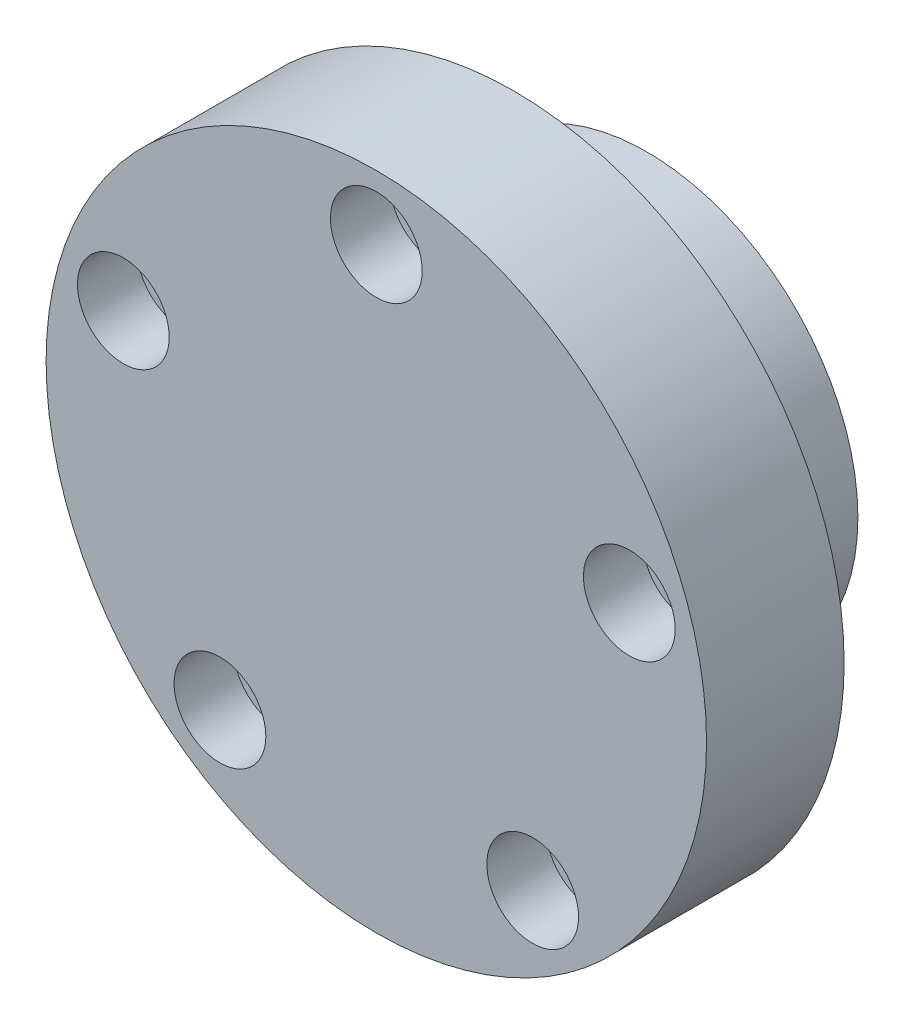
ISO-10303-21;
HEADER;
FILE_DESCRIPTION(('STEP AP214'),'2;1');
FILE_NAME('part.step','',(''),(''),'','','');
FILE_SCHEMA(('AUTOMOTIVE_DESIGN { 1 0 10303 214 1 1 1 1 }'));
ENDSEC;
DATA;
#1=APPLICATION_CONTEXT('core data for automotive mechanical design processes');
#2=APPLICATION_PROTOCOL_DEFINITION('international standard','automotive_design',2000,#1);
#3=PRODUCT_CONTEXT('',#1,'mechanical');
#4=PRODUCT('Part','Part','',(#3));
#5=PRODUCT_RELATED_PRODUCT_CATEGORY('part','',(#4));
#6=PRODUCT_DEFINITION_FORMATION('','',#4);
#7=PRODUCT_DEFINITION_CONTEXT('part definition',#1,'design');
#8=PRODUCT_DEFINITION('design','',#6,#7);
#9=PRODUCT_DEFINITION_SHAPE('','',#8);
#10=(LENGTH_UNIT() NAMED_UNIT(*) SI_UNIT(.MILLI.,.METRE.));
#11=(NAMED_UNIT(*) PLANE_ANGLE_UNIT() SI_UNIT($,.RADIAN.));
#12=(NAMED_UNIT(*) SI_UNIT($,.STERADIAN.) SOLID_ANGLE_UNIT());
#13=UNCERTAINTY_MEASURE_WITH_UNIT(LENGTH_MEASURE(1.E-05),#10,'distance_accuracy_value','');
#14=(GEOMETRIC_REPRESENTATION_CONTEXT(3) GLOBAL_UNCERTAINTY_ASSIGNED_CONTEXT((#13)) GLOBAL_UNIT_ASSIGNED_CONTEXT((#10,
#11,#12)) REPRESENTATION_CONTEXT('',''));
#15=CARTESIAN_POINT('',(0.,0.,0.));
#16=DIRECTION('',(0.,0.,1.));
#17=DIRECTION('',(1.,0.,0.));
#18=AXIS2_PLACEMENT_3D('',#15,#16,#17);
#19=CARTESIAN_POINT('',(-13.7903194862798,4.48074641843648,-9.25));
#20=DIRECTION('',(0.,0.,1.));
#21=DIRECTION('',(1.,0.,0.));
#22=AXIS2_PLACEMENT_3D('',#19,#20,#21);
#23=CYLINDRICAL_SURFACE('',#22,1.524);
#24=CARTESIAN_POINT('',(-13.7903194862798,4.48074641843648,0.));
#25=DIRECTION('',(0.,0.,1.));
#26=DIRECTION('',(1.,0.,0.));
#27=AXIS2_PLACEMENT_3D('',#24,#25,#26);
#28=CIRCLE('',#27,1.524);
#29=CARTESIAN_POINT('',(-12.2663194862798,4.48074641843648,0.));
#30=VERTEX_POINT('',#29);
#31=EDGE_CURVE('E55',#30,#30,#28,.T.);
#32=ORIENTED_EDGE('',*,*,#31,.F.);
#33=EDGE_LOOP('',(#32));
#34=FACE_BOUND('',#33,.T.);
#35=CARTESIAN_POINT('',(-13.7903194862798,4.48074641843648,4.25));
#36=DIRECTION('',(0.,0.,1.));
#37=DIRECTION('',(1.,0.,0.));
#38=AXIS2_PLACEMENT_3D('',#35,#36,#37);
#39=CIRCLE('',#38,1.524);
#40=CARTESIAN_POINT('',(-12.2663194862798,4.48074641843648,4.25));
#41=VERTEX_POINT('',#40);
#42=EDGE_CURVE('E37',#41,#41,#39,.F.);
#43=ORIENTED_EDGE('',*,*,#42,.F.);
#44=EDGE_LOOP('',(#43));
#45=FACE_BOUND('',#44,.T.);
#46=ADVANCED_FACE('F33',(#34,#45),#23,.F.);
#47=CARTESIAN_POINT('',(-8.5228861582407,-11.7307464184369,-9.25));
#48=DIRECTION('',(0.,0.,1.));
#49=DIRECTION('',(1.,0.,0.));
#50=AXIS2_PLACEMENT_3D('',#47,#48,#49);
#51=CYLINDRICAL_SURFACE('',#50,1.524);
#52=CARTESIAN_POINT('',(-8.5228861582407,-11.7307464184369,0.));
#53=DIRECTION('',(0.,0.,1.));
#54=DIRECTION('',(1.,0.,0.));
#55=AXIS2_PLACEMENT_3D('',#52,#53,#54);
#56=CIRCLE('',#55,1.524);
#57=CARTESIAN_POINT('',(-6.9988861582407,-11.7307464184369,0.));
#58=VERTEX_POINT('',#57);
#59=EDGE_CURVE('E58',#58,#58,#56,.T.);
#60=ORIENTED_EDGE('',*,*,#59,.F.);
#61=EDGE_LOOP('',(#60));
#62=FACE_BOUND('',#61,.T.);
#63=CARTESIAN_POINT('',(-8.5228861582407,-11.7307464184369,4.25));
#64=DIRECTION('',(0.,0.,1.));
#65=DIRECTION('',(1.,0.,0.));
#66=AXIS2_PLACEMENT_3D('',#63,#64,#65);
#67=CIRCLE('',#66,1.524);
#68=CARTESIAN_POINT('',(-6.9988861582407,-11.7307464184369,4.25));
#69=VERTEX_POINT('',#68);
#70=EDGE_CURVE('E76',#69,#69,#67,.F.);
#71=ORIENTED_EDGE('',*,*,#70,.F.);
#72=EDGE_LOOP('',(#71));
#73=FACE_BOUND('',#72,.T.);
#74=ADVANCED_FACE('F125',(#62,#73),#51,.F.);
#75=CARTESIAN_POINT('',(8.52288615824097,-11.7307464184367,-9.25));
#76=DIRECTION('',(0.,0.,1.));
#77=DIRECTION('',(1.,0.,0.));
#78=AXIS2_PLACEMENT_3D('',#75,#76,#77);
#79=CYLINDRICAL_SURFACE('',#78,1.524);
#80=CARTESIAN_POINT('',(8.52288615824097,-11.7307464184367,0.));
#81=DIRECTION('',(0.,0.,1.));
#82=DIRECTION('',(1.,0.,0.));
#83=AXIS2_PLACEMENT_3D('',#80,#81,#82);
#84=CIRCLE('',#83,1.524);
#85=CARTESIAN_POINT('',(10.046886158241,-11.7307464184367,0.));
#86=VERTEX_POINT('',#85);
#87=EDGE_CURVE('E62',#86,#86,#84,.T.);
#88=ORIENTED_EDGE('',*,*,#87,.F.);
#89=EDGE_LOOP('',(#88));
#90=FACE_BOUND('',#89,.T.);
#91=CARTESIAN_POINT('',(8.52288615824097,-11.7307464184367,4.25));
#92=DIRECTION('',(0.,0.,1.));
#93=DIRECTION('',(1.,0.,0.));
#94=AXIS2_PLACEMENT_3D('',#91,#92,#93);
#95=CIRCLE('',#94,1.524);
#96=CARTESIAN_POINT('',(10.046886158241,-11.7307464184367,4.25));
#97=VERTEX_POINT('',#96);
#98=EDGE_CURVE('E73',#97,#97,#95,.F.);
#99=ORIENTED_EDGE('',*,*,#98,.F.);
#100=EDGE_LOOP('',(#99));
#101=FACE_BOUND('',#100,.T.);
#102=ADVANCED_FACE('F131',(#90,#101),#79,.F.);
#103=CARTESIAN_POINT('',(13.7903194862797,4.4807464184368,-9.25));
#104=DIRECTION('',(0.,0.,1.));
#105=DIRECTION('',(1.,0.,0.));
#106=AXIS2_PLACEMENT_3D('',#103,#104,#105);
#107=CYLINDRICAL_SURFACE('',#106,1.524);
#108=CARTESIAN_POINT('',(13.7903194862797,4.4807464184368,0.));
#109=DIRECTION('',(0.,0.,1.));
#110=DIRECTION('',(1.,0.,0.));
#111=AXIS2_PLACEMENT_3D('',#108,#109,#110);
#112=CIRCLE('',#111,1.524);
#113=CARTESIAN_POINT('',(15.3143194862797,4.4807464184368,0.));
#114=VERTEX_POINT('',#113);
#115=EDGE_CURVE('E54',#114,#114,#112,.T.);
#116=ORIENTED_EDGE('',*,*,#115,.F.);
#117=EDGE_LOOP('',(#116));
#118=FACE_BOUND('',#117,.T.);
#119=CARTESIAN_POINT('',(13.7903194862797,4.4807464184368,4.25));
#120=DIRECTION('',(0.,0.,1.));
#121=DIRECTION('',(1.,0.,0.));
#122=AXIS2_PLACEMENT_3D('',#119,#120,#121);
#123=CIRCLE('',#122,1.524);
#124=CARTESIAN_POINT('',(15.3143194862797,4.4807464184368,4.25));
#125=VERTEX_POINT('',#124);
#126=EDGE_CURVE('E70',#125,#125,#123,.F.);
#127=ORIENTED_EDGE('',*,*,#126,.F.);
#128=EDGE_LOOP('',(#127));
#129=FACE_BOUND('',#128,.T.);
#130=ADVANCED_FACE('F141',(#118,#129),#107,.F.);
#131=CARTESIAN_POINT('',(0.,14.5,-9.25));
#132=DIRECTION('',(0.,0.,1.));
#133=DIRECTION('',(1.,0.,0.));
#134=AXIS2_PLACEMENT_3D('',#131,#132,#133);
#135=CYLINDRICAL_SURFACE('',#134,1.524);
#136=CARTESIAN_POINT('',(0.,14.5,0.));
#137=DIRECTION('',(0.,0.,1.));
#138=DIRECTION('',(1.,0.,0.));
#139=AXIS2_PLACEMENT_3D('',#136,#137,#138);
#140=CIRCLE('',#139,1.524);
#141=CARTESIAN_POINT('',(1.524,14.5,0.));
#142=VERTEX_POINT('',#141);
#143=EDGE_CURVE('E50',#142,#142,#140,.T.);
#144=ORIENTED_EDGE('',*,*,#143,.F.);
#145=EDGE_LOOP('',(#144));
#146=FACE_BOUND('',#145,.T.);
#147=CARTESIAN_POINT('',(0.,14.5,4.25));
#148=DIRECTION('',(0.,0.,1.));
#149=DIRECTION('',(1.,0.,0.));
#150=AXIS2_PLACEMENT_3D('',#147,#148,#149);
#151=CIRCLE('',#150,1.524);
#152=CARTESIAN_POINT('',(1.524,14.5,4.25));
#153=VERTEX_POINT('',#152);
#154=EDGE_CURVE('E59',#153,#153,#151,.F.);
#155=ORIENTED_EDGE('',*,*,#154,.F.);
#156=EDGE_LOOP('',(#155));
#157=FACE_BOUND('',#156,.T.);
#158=ADVANCED_FACE('F138',(#146,#157),#135,.F.);
#159=CARTESIAN_POINT('',(0.,0.,7.5));
#160=DIRECTION('',(0.,0.,-1.));
#161=DIRECTION('',(-1.,0.,0.));
#162=AXIS2_PLACEMENT_3D('',#159,#160,#161);
#163=CYLINDRICAL_SURFACE('',#162,18.);
#164=CARTESIAN_POINT('',(0.,0.,7.5));
#165=DIRECTION('',(0.,0.,1.));
#166=DIRECTION('',(1.,0.,0.));
#167=AXIS2_PLACEMENT_3D('',#164,#165,#166);
#168=CIRCLE('',#167,18.);
#169=CARTESIAN_POINT('',(18.,0.,7.5));
#170=VERTEX_POINT('',#169);
#171=EDGE_CURVE('E41',#170,#170,#168,.T.);
#172=ORIENTED_EDGE('',*,*,#171,.F.);
#173=EDGE_LOOP('',(#172));
#174=FACE_BOUND('',#173,.T.);
#175=CARTESIAN_POINT('',(0.,0.,0.));
#176=DIRECTION('',(0.,0.,1.));
#177=DIRECTION('',(1.,0.,0.));
#178=AXIS2_PLACEMENT_3D('',#175,#176,#177);
#179=CIRCLE('',#178,18.);
#180=CARTESIAN_POINT('',(18.,0.,0.));
#181=VERTEX_POINT('',#180);
#182=EDGE_CURVE('E46',#181,#181,#179,.T.);
#183=ORIENTED_EDGE('',*,*,#182,.T.);
#184=EDGE_LOOP('',(#183));
#185=FACE_BOUND('',#184,.T.);
#186=ADVANCED_FACE('F35',(#174,#185),#163,.T.);
#187=CARTESIAN_POINT('',(0.,0.,7.5));
#188=DIRECTION('',(0.,0.,1.));
#189=DIRECTION('',(1.,0.,0.));
#190=AXIS2_PLACEMENT_3D('',#187,#188,#189);
#191=PLANE('',#190);
#192=CARTESIAN_POINT('',(13.7903194862797,4.4807464184368,7.5));
#193=DIRECTION('',(0.,0.,1.));
#194=DIRECTION('',(1.,0.,0.));
#195=AXIS2_PLACEMENT_3D('',#192,#193,#194);
#196=CIRCLE('',#195,2.5);
#197=CARTESIAN_POINT('',(16.2903194862797,4.4807464184368,7.5));
#198=VERTEX_POINT('',#197);
#199=EDGE_CURVE('E364',#198,#198,#196,.T.);
#200=ORIENTED_EDGE('',*,*,#199,.F.);
#201=EDGE_LOOP('',(#200));
#202=FACE_BOUND('',#201,.T.);
#203=CARTESIAN_POINT('',(8.52288615824097,-11.7307464184367,7.5));
#204=DIRECTION('',(0.,0.,1.));
#205=DIRECTION('',(1.,0.,0.));
#206=AXIS2_PLACEMENT_3D('',#203,#204,#205);
#207=CIRCLE('',#206,2.5);
#208=CARTESIAN_POINT('',(11.022886158241,-11.7307464184367,7.5));
#209=VERTEX_POINT('',#208);
#210=EDGE_CURVE('E358',#209,#209,#207,.T.);
#211=ORIENTED_EDGE('',*,*,#210,.F.);
#212=EDGE_LOOP('',(#211));
#213=FACE_BOUND('',#212,.T.);
#214=CARTESIAN_POINT('',(-8.5228861582407,-11.7307464184369,7.5));
#215=DIRECTION('',(0.,0.,1.));
#216=DIRECTION('',(1.,0.,0.));
#217=AXIS2_PLACEMENT_3D('',#214,#215,#216);
#218=CIRCLE('',#217,2.5);
#219=CARTESIAN_POINT('',(-6.0228861582407,-11.7307464184369,7.5));
#220=VERTEX_POINT('',#219);
#221=EDGE_CURVE('E350',#220,#220,#218,.T.);
#222=ORIENTED_EDGE('',*,*,#221,.F.);
#223=EDGE_LOOP('',(#222));
#224=FACE_BOUND('',#223,.T.);
#225=CARTESIAN_POINT('',(-13.7903194862798,4.48074641843648,7.5));
#226=DIRECTION('',(0.,0.,1.));
#227=DIRECTION('',(1.,0.,0.));
#228=AXIS2_PLACEMENT_3D('',#225,#226,#227);
#229=CIRCLE('',#228,2.5);
#230=CARTESIAN_POINT('',(-11.2903194862798,4.48074641843648,7.5));
#231=VERTEX_POINT('',#230);
#232=EDGE_CURVE('E348',#231,#231,#229,.T.);
#233=ORIENTED_EDGE('',*,*,#232,.F.);
#234=EDGE_LOOP('',(#233));
#235=FACE_BOUND('',#234,.T.);
#236=CARTESIAN_POINT('',(0.,14.5,7.5));
#237=DIRECTION('',(0.,0.,1.));
#238=DIRECTION('',(1.,0.,0.));
#239=AXIS2_PLACEMENT_3D('',#236,#237,#238);
#240=CIRCLE('',#239,2.5);
#241=CARTESIAN_POINT('',(2.5,14.5,7.5));
#242=VERTEX_POINT('',#241);
#243=EDGE_CURVE('E81',#242,#242,#240,.T.);
#244=ORIENTED_EDGE('',*,*,#243,.F.);
#245=EDGE_LOOP('',(#244));
#246=FACE_BOUND('',#245,.T.);
#247=ORIENTED_EDGE('',*,*,#171,.T.);
#248=EDGE_LOOP('',(#247));
#249=FACE_BOUND('',#248,.T.);
#250=ADVANCED_FACE('F108',(#202,#213,#224,#235,#246,#249),#191,.T.);
#251=CARTESIAN_POINT('',(0.,0.,0.));
#252=DIRECTION('',(0.,0.,1.));
#253=DIRECTION('',(1.,0.,0.));
#254=AXIS2_PLACEMENT_3D('',#251,#252,#253);
#255=PLANE('',#254);
#256=ORIENTED_EDGE('',*,*,#115,.T.);
#257=EDGE_LOOP('',(#256));
#258=FACE_BOUND('',#257,.T.);
#259=ORIENTED_EDGE('',*,*,#87,.T.);
#260=EDGE_LOOP('',(#259));
#261=FACE_BOUND('',#260,.T.);
#262=ORIENTED_EDGE('',*,*,#59,.T.);
#263=EDGE_LOOP('',(#262));
#264=FACE_BOUND('',#263,.T.);
#265=ORIENTED_EDGE('',*,*,#31,.T.);
#266=EDGE_LOOP('',(#265));
#267=FACE_BOUND('',#266,.T.);
#268=ORIENTED_EDGE('',*,*,#143,.T.);
#269=EDGE_LOOP('',(#268));
#270=FACE_BOUND('',#269,.T.);
#271=CARTESIAN_POINT('',(0.,0.,0.));
#272=DIRECTION('',(0.,0.,1.));
#273=DIRECTION('',(1.,0.,0.));
#274=AXIS2_PLACEMENT_3D('',#271,#272,#273);
#275=CIRCLE('',#274,11.5);
#276=CARTESIAN_POINT('',(11.5,0.,0.));
#277=VERTEX_POINT('',#276);
#278=EDGE_CURVE('E10',#277,#277,#275,.F.);
#279=ORIENTED_EDGE('',*,*,#278,.F.);
#280=EDGE_LOOP('',(#279));
#281=FACE_BOUND('',#280,.T.);
#282=ORIENTED_EDGE('',*,*,#182,.F.);
#283=EDGE_LOOP('',(#282));
#284=FACE_BOUND('',#283,.T.);
#285=ADVANCED_FACE('F105',(#258,#261,#264,#267,#270,#281,#284),#255,.F.);
#286=CARTESIAN_POINT('',(0.,0.,-7.25));
#287=DIRECTION('',(0.,0.,-1.));
#288=DIRECTION('',(-1.,0.,0.));
#289=AXIS2_PLACEMENT_3D('',#286,#287,#288);
#290=PLANE('',#289);
#291=CARTESIAN_POINT('',(0.,0.,-7.25));
#292=DIRECTION('',(0.,0.,-1.));
#293=DIRECTION('',(-1.,0.,0.));
#294=AXIS2_PLACEMENT_3D('',#291,#292,#293);
#295=CIRCLE('',#294,11.5);
#296=CARTESIAN_POINT('',(-11.5,0.,-7.25));
#297=VERTEX_POINT('',#296);
#298=EDGE_CURVE('E95',#297,#297,#295,.T.);
#299=ORIENTED_EDGE('',*,*,#298,.T.);
#300=EDGE_LOOP('',(#299));
#301=FACE_BOUND('',#300,.T.);
#302=CARTESIAN_POINT('',(0.,0.,-7.25));
#303=DIRECTION('',(0.,0.,-1.));
#304=DIRECTION('',(-1.,0.,0.));
#305=AXIS2_PLACEMENT_3D('',#302,#303,#304);
#306=CIRCLE('',#305,4.5);
#307=CARTESIAN_POINT('',(-4.5,0.,-7.25));
#308=VERTEX_POINT('',#307);
#309=EDGE_CURVE('E92',#308,#308,#306,.T.);
#310=ORIENTED_EDGE('',*,*,#309,.F.);
#311=EDGE_LOOP('',(#310));
#312=FACE_BOUND('',#311,.T.);
#313=ADVANCED_FACE('F107',(#301,#312),#290,.T.);
#314=CARTESIAN_POINT('',(0.,0.,-7.25));
#315=DIRECTION('',(0.,0.,1.));
#316=DIRECTION('',(1.,0.,0.));
#317=AXIS2_PLACEMENT_3D('',#314,#315,#316);
#318=CYLINDRICAL_SURFACE('',#317,11.5);
#319=ORIENTED_EDGE('',*,*,#298,.F.);
#320=EDGE_LOOP('',(#319));
#321=FACE_BOUND('',#320,.T.);
#322=ORIENTED_EDGE('',*,*,#278,.T.);
#323=EDGE_LOOP('',(#322));
#324=FACE_BOUND('',#323,.T.);
#325=ADVANCED_FACE('F115',(#321,#324),#318,.T.);
#326=CARTESIAN_POINT('',(0.,0.,-7.25));
#327=DIRECTION('',(0.,0.,1.));
#328=DIRECTION('',(1.,0.,0.));
#329=AXIS2_PLACEMENT_3D('',#326,#327,#328);
#330=CYLINDRICAL_SURFACE('',#329,4.5);
#331=ORIENTED_EDGE('',*,*,#309,.T.);
#332=EDGE_LOOP('',(#331));
#333=FACE_BOUND('',#332,.T.);
#334=CARTESIAN_POINT('',(0.,0.,0.));
#335=DIRECTION('',(0.,0.,-1.));
#336=DIRECTION('',(-1.,0.,0.));
#337=AXIS2_PLACEMENT_3D('',#334,#335,#336);
#338=CIRCLE('',#337,4.5);
#339=CARTESIAN_POINT('',(-4.5,0.,0.));
#340=VERTEX_POINT('',#339);
#341=EDGE_CURVE('E53',#340,#340,#338,.T.);
#342=ORIENTED_EDGE('',*,*,#341,.F.);
#343=EDGE_LOOP('',(#342));
#344=FACE_BOUND('',#343,.T.);
#345=ADVANCED_FACE('F122',(#333,#344),#330,.F.);
#346=ORIENTED_EDGE('',*,*,#341,.T.);
#347=EDGE_LOOP('',(#346));
#348=FACE_BOUND('',#347,.T.);
#349=ADVANCED_FACE('F110',(#348),#255,.F.);
#350=CARTESIAN_POINT('',(0.,14.5,4.25));
#351=DIRECTION('',(0.,0.,1.));
#352=DIRECTION('',(1.,0.,0.));
#353=AXIS2_PLACEMENT_3D('',#350,#351,#352);
#354=PLANE('',#353);
#355=CARTESIAN_POINT('',(0.,14.5,4.25));
#356=DIRECTION('',(0.,0.,1.));
#357=DIRECTION('',(1.,0.,0.));
#358=AXIS2_PLACEMENT_3D('',#355,#356,#357);
#359=CIRCLE('',#358,2.5);
#360=CARTESIAN_POINT('',(2.5,14.5,4.25));
#361=VERTEX_POINT('',#360);
#362=EDGE_CURVE('E69',#361,#361,#359,.T.);
#363=ORIENTED_EDGE('',*,*,#362,.T.);
#364=EDGE_LOOP('',(#363));
#365=FACE_BOUND('',#364,.T.);
#366=ORIENTED_EDGE('',*,*,#154,.T.);
#367=EDGE_LOOP('',(#366));
#368=FACE_BOUND('',#367,.T.);
#369=ADVANCED_FACE('F121',(#365,#368),#354,.T.);
#370=CARTESIAN_POINT('',(0.,14.5,4.25));
#371=DIRECTION('',(0.,0.,1.));
#372=DIRECTION('',(1.,0.,0.));
#373=AXIS2_PLACEMENT_3D('',#370,#371,#372);
#374=CYLINDRICAL_SURFACE('',#373,2.5);
#375=ORIENTED_EDGE('',*,*,#362,.F.);
#376=EDGE_LOOP('',(#375));
#377=FACE_BOUND('',#376,.T.);
#378=ORIENTED_EDGE('',*,*,#243,.T.);
#379=EDGE_LOOP('',(#378));
#380=FACE_BOUND('',#379,.T.);
#381=ADVANCED_FACE('F166',(#377,#380),#374,.F.);
#382=CARTESIAN_POINT('',(13.7903194862797,4.4807464184368,4.25));
#383=DIRECTION('',(0.,0.,1.));
#384=DIRECTION('',(1.,0.,0.));
#385=AXIS2_PLACEMENT_3D('',#382,#383,#384);
#386=PLANE('',#385);
#387=CARTESIAN_POINT('',(13.7903194862797,4.4807464184368,4.25));
#388=DIRECTION('',(0.,0.,1.));
#389=DIRECTION('',(1.,0.,0.));
#390=AXIS2_PLACEMENT_3D('',#387,#388,#389);
#391=CIRCLE('',#390,2.5);
#392=CARTESIAN_POINT('',(16.2903194862797,4.4807464184368,4.25));
#393=VERTEX_POINT('',#392);
#394=EDGE_CURVE('E74',#393,#393,#391,.T.);
#395=ORIENTED_EDGE('',*,*,#394,.T.);
#396=EDGE_LOOP('',(#395));
#397=FACE_BOUND('',#396,.T.);
#398=ORIENTED_EDGE('',*,*,#126,.T.);
#399=EDGE_LOOP('',(#398));
#400=FACE_BOUND('',#399,.T.);
#401=ADVANCED_FACE('F175',(#397,#400),#386,.T.);
#402=CARTESIAN_POINT('',(13.7903194862797,4.4807464184368,4.25));
#403=DIRECTION('',(0.,0.,1.));
#404=DIRECTION('',(1.,0.,0.));
#405=AXIS2_PLACEMENT_3D('',#402,#403,#404);
#406=CYLINDRICAL_SURFACE('',#405,2.5);
#407=ORIENTED_EDGE('',*,*,#394,.F.);
#408=EDGE_LOOP('',(#407));
#409=FACE_BOUND('',#408,.T.);
#410=ORIENTED_EDGE('',*,*,#199,.T.);
#411=EDGE_LOOP('',(#410));
#412=FACE_BOUND('',#411,.T.);
#413=ADVANCED_FACE('F183',(#409,#412),#406,.F.);
#414=CARTESIAN_POINT('',(8.52288615824097,-11.7307464184367,4.25));
#415=DIRECTION('',(0.,0.,1.));
#416=DIRECTION('',(1.,0.,0.));
#417=AXIS2_PLACEMENT_3D('',#414,#415,#416);
#418=PLANE('',#417);
#419=CARTESIAN_POINT('',(8.52288615824097,-11.7307464184367,4.25));
#420=DIRECTION('',(0.,0.,1.));
#421=DIRECTION('',(1.,0.,0.));
#422=AXIS2_PLACEMENT_3D('',#419,#420,#421);
#423=CIRCLE('',#422,2.5);
#424=CARTESIAN_POINT('',(11.022886158241,-11.7307464184367,4.25));
#425=VERTEX_POINT('',#424);
#426=EDGE_CURVE('E361',#425,#425,#423,.T.);
#427=ORIENTED_EDGE('',*,*,#426,.T.);
#428=EDGE_LOOP('',(#427));
#429=FACE_BOUND('',#428,.T.);
#430=ORIENTED_EDGE('',*,*,#98,.T.);
#431=EDGE_LOOP('',(#430));
#432=FACE_BOUND('',#431,.T.);
#433=ADVANCED_FACE('F191',(#429,#432),#418,.T.);
#434=CARTESIAN_POINT('',(8.52288615824097,-11.7307464184367,4.25));
#435=DIRECTION('',(0.,0.,1.));
#436=DIRECTION('',(1.,0.,0.));
#437=AXIS2_PLACEMENT_3D('',#434,#435,#436);
#438=CYLINDRICAL_SURFACE('',#437,2.5);
#439=ORIENTED_EDGE('',*,*,#426,.F.);
#440=EDGE_LOOP('',(#439));
#441=FACE_BOUND('',#440,.T.);
#442=ORIENTED_EDGE('',*,*,#210,.T.);
#443=EDGE_LOOP('',(#442));
#444=FACE_BOUND('',#443,.T.);
#445=ADVANCED_FACE('F199',(#441,#444),#438,.F.);
#446=CARTESIAN_POINT('',(-8.5228861582407,-11.7307464184369,4.25));
#447=DIRECTION('',(0.,0.,1.));
#448=DIRECTION('',(1.,0.,0.));
#449=AXIS2_PLACEMENT_3D('',#446,#447,#448);
#450=PLANE('',#449);
#451=CARTESIAN_POINT('',(-8.5228861582407,-11.7307464184369,4.25));
#452=DIRECTION('',(0.,0.,1.));
#453=DIRECTION('',(1.,0.,0.));
#454=AXIS2_PLACEMENT_3D('',#451,#452,#453);
#455=CIRCLE('',#454,2.5);
#456=CARTESIAN_POINT('',(-6.0228861582407,-11.7307464184369,4.25));
#457=VERTEX_POINT('',#456);
#458=EDGE_CURVE('E355',#457,#457,#455,.T.);
#459=ORIENTED_EDGE('',*,*,#458,.T.);
#460=EDGE_LOOP('',(#459));
#461=FACE_BOUND('',#460,.T.);
#462=ORIENTED_EDGE('',*,*,#70,.T.);
#463=EDGE_LOOP('',(#462));
#464=FACE_BOUND('',#463,.T.);
#465=ADVANCED_FACE('F207',(#461,#464),#450,.T.);
#466=CARTESIAN_POINT('',(-8.5228861582407,-11.7307464184369,4.25));
#467=DIRECTION('',(0.,0.,1.));
#468=DIRECTION('',(1.,0.,0.));
#469=AXIS2_PLACEMENT_3D('',#466,#467,#468);
#470=CYLINDRICAL_SURFACE('',#469,2.5);
#471=ORIENTED_EDGE('',*,*,#458,.F.);
#472=EDGE_LOOP('',(#471));
#473=FACE_BOUND('',#472,.T.);
#474=ORIENTED_EDGE('',*,*,#221,.T.);
#475=EDGE_LOOP('',(#474));
#476=FACE_BOUND('',#475,.T.);
#477=ADVANCED_FACE('F215',(#473,#476),#470,.F.);
#478=CARTESIAN_POINT('',(-13.7903194862798,4.48074641843648,4.25));
#479=DIRECTION('',(0.,0.,1.));
#480=DIRECTION('',(1.,0.,0.));
#481=AXIS2_PLACEMENT_3D('',#478,#479,#480);
#482=PLANE('',#481);
#483=CARTESIAN_POINT('',(-13.7903194862798,4.48074641843648,4.25));
#484=DIRECTION('',(0.,0.,1.));
#485=DIRECTION('',(1.,0.,0.));
#486=AXIS2_PLACEMENT_3D('',#483,#484,#485);
#487=CIRCLE('',#486,2.5);
#488=CARTESIAN_POINT('',(-11.2903194862798,4.48074641843648,4.25));
#489=VERTEX_POINT('',#488);
#490=EDGE_CURVE('E345',#489,#489,#487,.T.);
#491=ORIENTED_EDGE('',*,*,#490,.T.);
#492=EDGE_LOOP('',(#491));
#493=FACE_BOUND('',#492,.T.);
#494=ORIENTED_EDGE('',*,*,#42,.T.);
#495=EDGE_LOOP('',(#494));
#496=FACE_BOUND('',#495,.T.);
#497=ADVANCED_FACE('F223',(#493,#496),#482,.T.);
#498=CARTESIAN_POINT('',(-13.7903194862798,4.48074641843648,4.25));
#499=DIRECTION('',(0.,0.,1.));
#500=DIRECTION('',(1.,0.,0.));
#501=AXIS2_PLACEMENT_3D('',#498,#499,#500);
#502=CYLINDRICAL_SURFACE('',#501,2.5);
#503=ORIENTED_EDGE('',*,*,#490,.F.);
#504=EDGE_LOOP('',(#503));
#505=FACE_BOUND('',#504,.T.);
#506=ORIENTED_EDGE('',*,*,#232,.T.);
#507=EDGE_LOOP('',(#506));
#508=FACE_BOUND('',#507,.T.);
#509=ADVANCED_FACE('F231',(#505,#508),#502,.F.);
#510=CLOSED_SHELL('',(#46,#74,#102,#130,#158,#186,#250,#285,#313,#325,#345,#349,#369,#381,#401,
#413,#433,#445,#465,#477,#497,#509));
#511=MANIFOLD_SOLID_BREP('B2',#510);
#512=ADVANCED_BREP_SHAPE_REPRESENTATION('',(#18,#511),#14);
#513=SHAPE_DEFINITION_REPRESENTATION(#9,#512);
ENDSEC;
END-ISO-10303-21;
